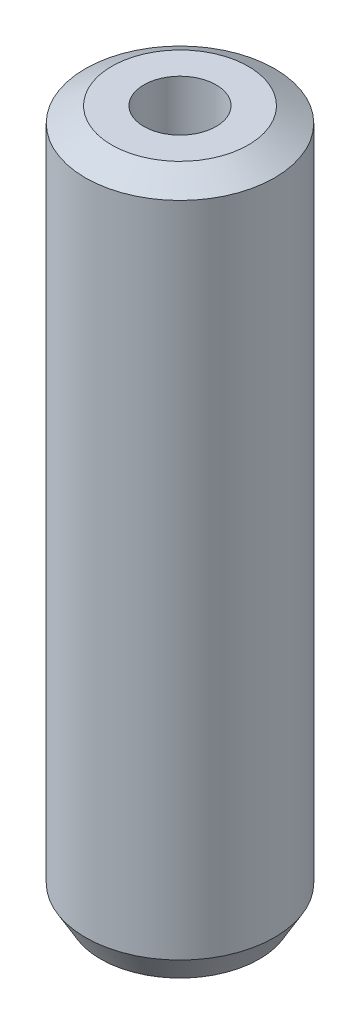
ISO-10303-21;
HEADER;
FILE_DESCRIPTION(('STEP AP214'),'2;1');
FILE_NAME('part.step','',(''),(''),'','','');
FILE_SCHEMA(('AUTOMOTIVE_DESIGN { 1 0 10303 214 1 1 1 1 }'));
ENDSEC;
DATA;
#1=APPLICATION_CONTEXT('core data for automotive mechanical design processes');
#2=APPLICATION_PROTOCOL_DEFINITION('international standard','automotive_design',2000,#1);
#3=PRODUCT_CONTEXT('',#1,'mechanical');
#4=PRODUCT('Part','Part','',(#3));
#5=PRODUCT_RELATED_PRODUCT_CATEGORY('part','',(#4));
#6=PRODUCT_DEFINITION_FORMATION('','',#4);
#7=PRODUCT_DEFINITION_CONTEXT('part definition',#1,'design');
#8=PRODUCT_DEFINITION('design','',#6,#7);
#9=PRODUCT_DEFINITION_SHAPE('','',#8);
#10=(LENGTH_UNIT() NAMED_UNIT(*) SI_UNIT(.MILLI.,.METRE.));
#11=(NAMED_UNIT(*) PLANE_ANGLE_UNIT() SI_UNIT($,.RADIAN.));
#12=(NAMED_UNIT(*) SI_UNIT($,.STERADIAN.) SOLID_ANGLE_UNIT());
#13=UNCERTAINTY_MEASURE_WITH_UNIT(LENGTH_MEASURE(1.E-05),#10,'distance_accuracy_value','');
#14=(GEOMETRIC_REPRESENTATION_CONTEXT(3) GLOBAL_UNCERTAINTY_ASSIGNED_CONTEXT((#13)) GLOBAL_UNIT_ASSIGNED_CONTEXT((#10,
#11,#12)) REPRESENTATION_CONTEXT('',''));
#15=CARTESIAN_POINT('',(0.,0.,0.));
#16=DIRECTION('',(0.,0.,1.));
#17=DIRECTION('',(1.,0.,0.));
#18=AXIS2_PLACEMENT_3D('',#15,#16,#17);
#19=CARTESIAN_POINT('',(0.,221.817528086275,0.));
#20=DIRECTION('',(0.,-1.,0.));
#21=DIRECTION('',(0.,0.,-1.));
#22=AXIS2_PLACEMENT_3D('',#19,#20,#21);
#23=CYLINDRICAL_SURFACE('',#22,30.);
#24=CARTESIAN_POINT('',(0.,216.990100416672,0.));
#25=DIRECTION('',(0.,1.,0.));
#26=DIRECTION('',(0.,0.,1.));
#27=AXIS2_PLACEMENT_3D('',#24,#25,#26);
#28=CIRCLE('',#27,30.);
#29=CARTESIAN_POINT('',(0.,216.990100416672,30.));
#30=VERTEX_POINT('',#29);
#31=EDGE_CURVE('E50',#30,#30,#28,.F.);
#32=ORIENTED_EDGE('',*,*,#31,.T.);
#33=EDGE_LOOP('',(#32));
#34=FACE_BOUND('',#33,.T.);
#35=CARTESIAN_POINT('',(0.,8.36134999361612,0.));
#36=DIRECTION('',(0.,1.,0.));
#37=DIRECTION('',(0.,0.,1.));
#38=AXIS2_PLACEMENT_3D('',#35,#36,#37);
#39=CIRCLE('',#38,30.);
#40=CARTESIAN_POINT('',(0.,8.36134999361612,30.));
#41=VERTEX_POINT('',#40);
#42=EDGE_CURVE('E51',#41,#41,#39,.T.);
#43=ORIENTED_EDGE('',*,*,#42,.T.);
#44=EDGE_LOOP('',(#43));
#45=FACE_BOUND('',#44,.T.);
#46=ADVANCED_FACE('F39',(#34,#45),#23,.T.);
#47=CARTESIAN_POINT('',(0.,221.817528086275,0.));
#48=DIRECTION('',(0.,1.,0.));
#49=DIRECTION('',(0.,0.,1.));
#50=AXIS2_PLACEMENT_3D('',#47,#48,#49);
#51=PLANE('',#50);
#52=CARTESIAN_POINT('',(0.,221.817528086275,0.));
#53=DIRECTION('',(0.,1.,0.));
#54=DIRECTION('',(0.,0.,1.));
#55=AXIS2_PLACEMENT_3D('',#52,#53,#54);
#56=CIRCLE('',#55,21.6386500063839);
#57=CARTESIAN_POINT('',(0.,221.817528086275,21.6386500063839));
#58=VERTEX_POINT('',#57);
#59=EDGE_CURVE('E54',#58,#58,#56,.T.);
#60=ORIENTED_EDGE('',*,*,#59,.T.);
#61=EDGE_LOOP('',(#60));
#62=FACE_BOUND('',#61,.T.);
#63=CARTESIAN_POINT('',(0.,221.817528086275,0.));
#64=DIRECTION('',(0.,1.,0.));
#65=DIRECTION('',(0.,0.,1.));
#66=AXIS2_PLACEMENT_3D('',#63,#64,#65);
#67=CIRCLE('',#66,11.4549096002492);
#68=CARTESIAN_POINT('',(0.,221.817528086275,11.4549096002492));
#69=VERTEX_POINT('',#68);
#70=EDGE_CURVE('E58',#69,#69,#67,.T.);
#71=ORIENTED_EDGE('',*,*,#70,.F.);
#72=EDGE_LOOP('',(#71));
#73=FACE_BOUND('',#72,.T.);
#74=ADVANCED_FACE('F69',(#62,#73),#51,.T.);
#75=CARTESIAN_POINT('',(0.,0.,0.));
#76=DIRECTION('',(0.,1.,0.));
#77=DIRECTION('',(0.,0.,1.));
#78=AXIS2_PLACEMENT_3D('',#75,#76,#77);
#79=PLANE('',#78);
#80=CARTESIAN_POINT('',(0.,0.,0.));
#81=DIRECTION('',(0.,1.,0.));
#82=DIRECTION('',(0.,0.,1.));
#83=AXIS2_PLACEMENT_3D('',#80,#81,#82);
#84=CIRCLE('',#83,25.172572330397);
#85=CARTESIAN_POINT('',(0.,0.,25.172572330397));
#86=VERTEX_POINT('',#85);
#87=EDGE_CURVE('E10',#86,#86,#84,.F.);
#88=ORIENTED_EDGE('',*,*,#87,.T.);
#89=EDGE_LOOP('',(#88));
#90=FACE_BOUND('',#89,.T.);
#91=CARTESIAN_POINT('',(0.,0.,0.));
#92=DIRECTION('',(0.,1.,0.));
#93=DIRECTION('',(0.,0.,1.));
#94=AXIS2_PLACEMENT_3D('',#91,#92,#93);
#95=CIRCLE('',#94,11.4549096002492);
#96=CARTESIAN_POINT('',(0.,0.,11.4549096002492));
#97=VERTEX_POINT('',#96);
#98=EDGE_CURVE('E63',#97,#97,#95,.T.);
#99=ORIENTED_EDGE('',*,*,#98,.T.);
#100=EDGE_LOOP('',(#99));
#101=FACE_BOUND('',#100,.T.);
#102=ADVANCED_FACE('F75',(#90,#101),#79,.F.);
#103=CARTESIAN_POINT('',(0.,221.817528086275,0.));
#104=DIRECTION('',(0.,-1.,0.));
#105=DIRECTION('',(0.,0.,-1.));
#106=AXIS2_PLACEMENT_3D('',#103,#104,#105);
#107=CYLINDRICAL_SURFACE('',#106,11.4549096002492);
#108=ORIENTED_EDGE('',*,*,#70,.T.);
#109=EDGE_LOOP('',(#108));
#110=FACE_BOUND('',#109,.T.);
#111=ORIENTED_EDGE('',*,*,#98,.F.);
#112=EDGE_LOOP('',(#111));
#113=FACE_BOUND('',#112,.T.);
#114=ADVANCED_FACE('F70',(#110,#113),#107,.F.);
#115=CARTESIAN_POINT('',(0.,221.817528086275,0.));
#116=DIRECTION('',(0.,-1.,0.));
#117=DIRECTION('',(0.,0.,-1.));
#118=AXIS2_PLACEMENT_3D('',#115,#116,#117);
#119=CONICAL_SURFACE('',#118,21.6386500063839,1.0471975511966);
#120=ORIENTED_EDGE('',*,*,#31,.F.);
#121=EDGE_LOOP('',(#120));
#122=FACE_BOUND('',#121,.T.);
#123=ORIENTED_EDGE('',*,*,#59,.F.);
#124=EDGE_LOOP('',(#123));
#125=FACE_BOUND('',#124,.T.);
#126=ADVANCED_FACE('F81',(#122,#125),#119,.T.);
#127=CARTESIAN_POINT('',(0.,8.36134999361612,0.));
#128=DIRECTION('',(0.,1.,0.));
#129=DIRECTION('',(0.,0.,1.));
#130=AXIS2_PLACEMENT_3D('',#127,#128,#129);
#131=CONICAL_SURFACE('',#130,30.,0.523598775598303);
#132=ORIENTED_EDGE('',*,*,#87,.F.);
#133=EDGE_LOOP('',(#132));
#134=FACE_BOUND('',#133,.T.);
#135=ORIENTED_EDGE('',*,*,#42,.F.);
#136=EDGE_LOOP('',(#135));
#137=FACE_BOUND('',#136,.T.);
#138=ADVANCED_FACE('F45',(#134,#137),#131,.T.);
#139=CLOSED_SHELL('',(#46,#74,#102,#114,#126,#138));
#140=MANIFOLD_SOLID_BREP('B2',#139);
#141=ADVANCED_BREP_SHAPE_REPRESENTATION('',(#18,#140),#14);
#142=SHAPE_DEFINITION_REPRESENTATION(#9,#141);
ENDSEC;
END-ISO-10303-21;
